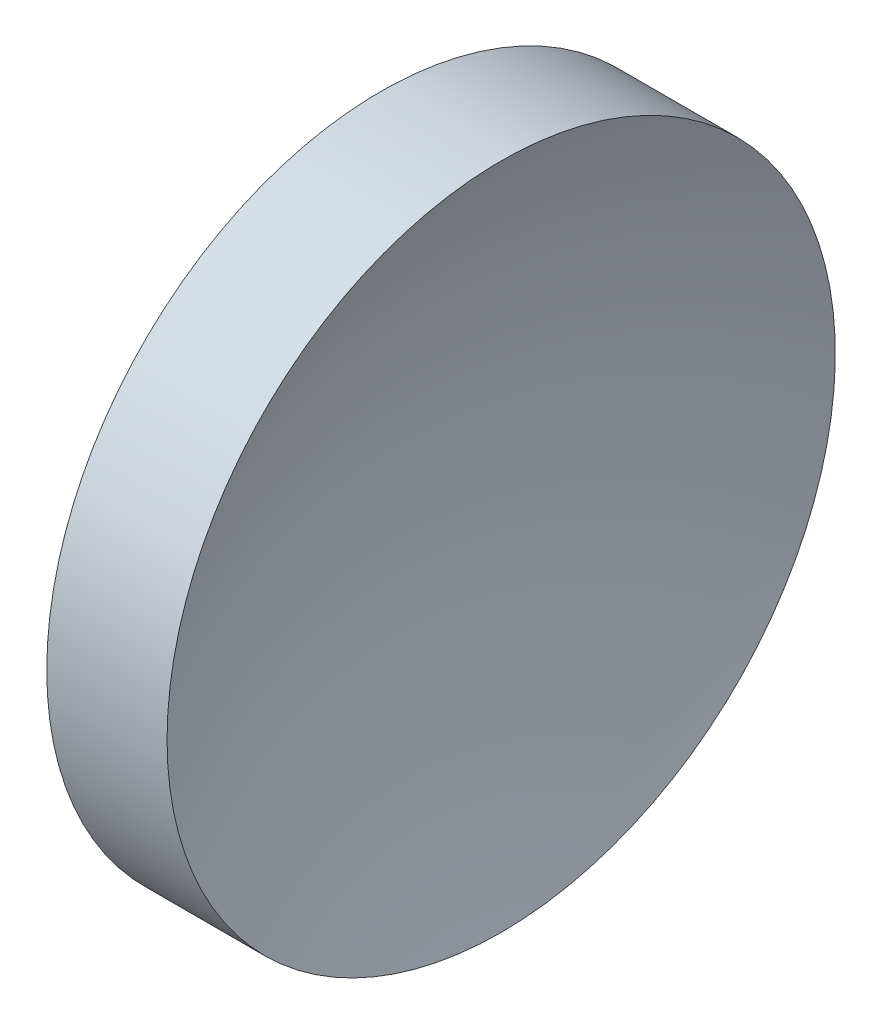
ISO-10303-21;
HEADER;
FILE_DESCRIPTION(('STEP AP214'),'2;1');
FILE_NAME('part.step','',(''),(''),'','','');
FILE_SCHEMA(('AUTOMOTIVE_DESIGN { 1 0 10303 214 1 1 1 1 }'));
ENDSEC;
DATA;
#1=APPLICATION_CONTEXT('core data for automotive mechanical design processes');
#2=APPLICATION_PROTOCOL_DEFINITION('international standard','automotive_design',2000,#1);
#3=PRODUCT_CONTEXT('',#1,'mechanical');
#4=PRODUCT('Part','Part','',(#3));
#5=PRODUCT_RELATED_PRODUCT_CATEGORY('part','',(#4));
#6=PRODUCT_DEFINITION_FORMATION('','',#4);
#7=PRODUCT_DEFINITION_CONTEXT('part definition',#1,'design');
#8=PRODUCT_DEFINITION('design','',#6,#7);
#9=PRODUCT_DEFINITION_SHAPE('','',#8);
#10=(LENGTH_UNIT() NAMED_UNIT(*) SI_UNIT(.MILLI.,.METRE.));
#11=(NAMED_UNIT(*) PLANE_ANGLE_UNIT() SI_UNIT($,.RADIAN.));
#12=(NAMED_UNIT(*) SI_UNIT($,.STERADIAN.) SOLID_ANGLE_UNIT());
#13=UNCERTAINTY_MEASURE_WITH_UNIT(LENGTH_MEASURE(1.E-05),#10,'distance_accuracy_value','');
#14=(GEOMETRIC_REPRESENTATION_CONTEXT(3) GLOBAL_UNCERTAINTY_ASSIGNED_CONTEXT((#13)) GLOBAL_UNIT_ASSIGNED_CONTEXT((#10,
#11,#12)) REPRESENTATION_CONTEXT('',''));
#15=CARTESIAN_POINT('',(0.,0.,0.));
#16=DIRECTION('',(0.,0.,1.));
#17=DIRECTION('',(1.,0.,0.));
#18=AXIS2_PLACEMENT_3D('',#15,#16,#17);
#19=CARTESIAN_POINT('',(92.0323370525261,32.6107681292268,0.));
#20=DIRECTION('',(-1.,0.,0.));
#21=DIRECTION('',(0.,-1.,0.));
#22=AXIS2_PLACEMENT_3D('',#19,#20,#21);
#23=SPHERICAL_SURFACE('',#22,32.5);
#24=CARTESIAN_POINT('',(62.0323370525261,32.6107681292268,0.));
#25=DIRECTION('',(-1.,0.,0.));
#26=DIRECTION('',(0.,0.,1.));
#27=AXIS2_PLACEMENT_3D('',#24,#25,#26);
#28=CIRCLE('',#27,12.5);
#29=CARTESIAN_POINT('',(62.0323370525261,32.6107681292268,12.5));
#30=VERTEX_POINT('',#29);
#31=EDGE_CURVE('E10',#30,#30,#28,.T.);
#32=ORIENTED_EDGE('',*,*,#31,.F.);
#33=EDGE_LOOP('',(#32));
#34=FACE_BOUND('',#33,.T.);
#35=ADVANCED_FACE('F35',(#34),#23,.F.);
#36=CARTESIAN_POINT('',(56.1009150799972,32.6107681292268,0.));
#37=DIRECTION('',(-1.,0.,0.));
#38=DIRECTION('',(0.,0.,1.));
#39=AXIS2_PLACEMENT_3D('',#36,#37,#38);
#40=CYLINDRICAL_SURFACE('',#39,12.5);
#41=CARTESIAN_POINT('',(57.5323370525261,32.6107681292268,0.));
#42=DIRECTION('',(-1.,0.,0.));
#43=DIRECTION('',(0.,0.,1.));
#44=AXIS2_PLACEMENT_3D('',#41,#42,#43);
#45=CIRCLE('',#44,12.5);
#46=CARTESIAN_POINT('',(57.5323370525261,32.6107681292268,12.5));
#47=VERTEX_POINT('',#46);
#48=EDGE_CURVE('E41',#47,#47,#45,.T.);
#49=ORIENTED_EDGE('',*,*,#48,.F.);
#50=EDGE_LOOP('',(#49));
#51=FACE_BOUND('',#50,.T.);
#52=ORIENTED_EDGE('',*,*,#31,.T.);
#53=EDGE_LOOP('',(#52));
#54=FACE_BOUND('',#53,.T.);
#55=ADVANCED_FACE('F49',(#51,#54),#40,.T.);
#56=CARTESIAN_POINT('',(57.5323370525261,32.6107681292268,0.));
#57=DIRECTION('',(1.,0.,0.));
#58=DIRECTION('',(0.,0.,-1.));
#59=AXIS2_PLACEMENT_3D('',#56,#57,#58);
#60=PLANE('',#59);
#61=ORIENTED_EDGE('',*,*,#48,.T.);
#62=EDGE_LOOP('',(#61));
#63=FACE_BOUND('',#62,.T.);
#64=ADVANCED_FACE('F47',(#63),#60,.F.);
#65=CLOSED_SHELL('',(#35,#55,#64));
#66=MANIFOLD_SOLID_BREP('B2',#65);
#67=ADVANCED_BREP_SHAPE_REPRESENTATION('',(#18,#66),#14);
#68=SHAPE_DEFINITION_REPRESENTATION(#9,#67);
ENDSEC;
END-ISO-10303-21;
